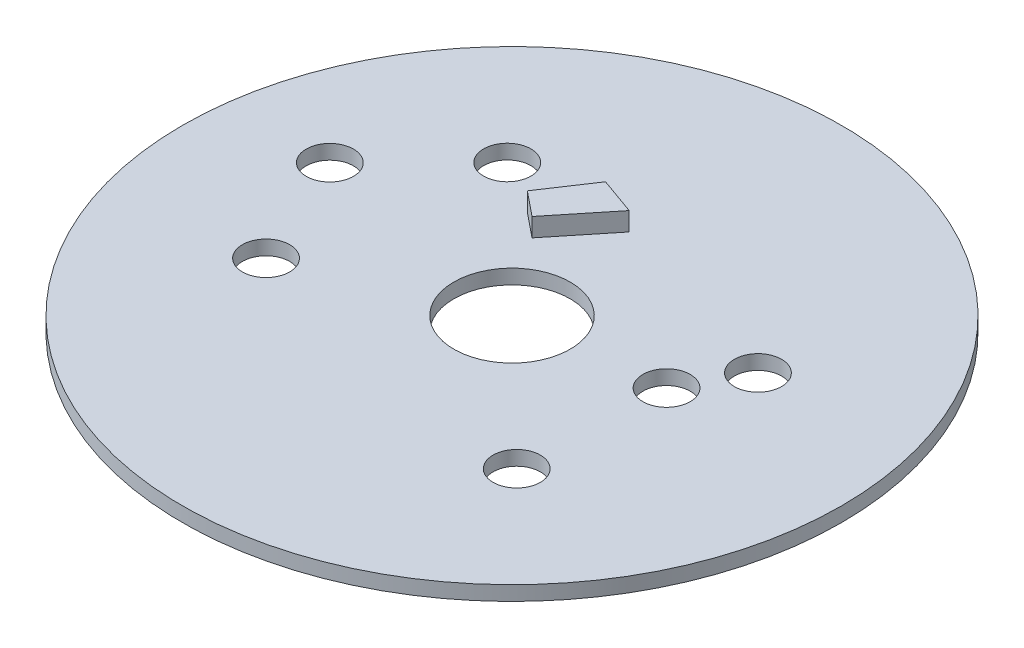
ISO-10303-21;
HEADER;
FILE_DESCRIPTION(('STEP AP214'),'2;1');
FILE_NAME('part.step','',(''),(''),'','','');
FILE_SCHEMA(('AUTOMOTIVE_DESIGN { 1 0 10303 214 1 1 1 1 }'));
ENDSEC;
DATA;
#1=APPLICATION_CONTEXT('core data for automotive mechanical design processes');
#2=APPLICATION_PROTOCOL_DEFINITION('international standard','automotive_design',2000,#1);
#3=PRODUCT_CONTEXT('',#1,'mechanical');
#4=PRODUCT('Part','Part','',(#3));
#5=PRODUCT_RELATED_PRODUCT_CATEGORY('part','',(#4));
#6=PRODUCT_DEFINITION_FORMATION('','',#4);
#7=PRODUCT_DEFINITION_CONTEXT('part definition',#1,'design');
#8=PRODUCT_DEFINITION('design','',#6,#7);
#9=PRODUCT_DEFINITION_SHAPE('','',#8);
#10=(LENGTH_UNIT() NAMED_UNIT(*) SI_UNIT(.MILLI.,.METRE.));
#11=(NAMED_UNIT(*) PLANE_ANGLE_UNIT() SI_UNIT($,.RADIAN.));
#12=(NAMED_UNIT(*) SI_UNIT($,.STERADIAN.) SOLID_ANGLE_UNIT());
#13=UNCERTAINTY_MEASURE_WITH_UNIT(LENGTH_MEASURE(1.E-05),#10,'distance_accuracy_value','');
#14=(GEOMETRIC_REPRESENTATION_CONTEXT(3) GLOBAL_UNCERTAINTY_ASSIGNED_CONTEXT((#13)) GLOBAL_UNIT_ASSIGNED_CONTEXT((#10,
#11,#12)) REPRESENTATION_CONTEXT('',''));
#15=CARTESIAN_POINT('',(0.,0.,0.));
#16=DIRECTION('',(0.,0.,1.));
#17=DIRECTION('',(1.,0.,0.));
#18=AXIS2_PLACEMENT_3D('',#15,#16,#17);
#19=CARTESIAN_POINT('',(-31.2205553056276,2.032,-5.77403034355452));
#20=DIRECTION('',(0.,-1.,0.));
#21=DIRECTION('',(1.,0.,0.));
#22=AXIS2_PLACEMENT_3D('',#19,#20,#21);
#23=CYLINDRICAL_SURFACE('',#22,3.302);
#24=CARTESIAN_POINT('',(-31.2205553056276,0.,-5.77403034355452));
#25=DIRECTION('',(0.,-1.,0.));
#26=DIRECTION('',(-1.,0.,0.));
#27=AXIS2_PLACEMENT_3D('',#24,#25,#26);
#28=CIRCLE('',#27,3.302);
#29=CARTESIAN_POINT('',(-34.5225553056276,0.,-5.77403034355452));
#30=VERTEX_POINT('',#29);
#31=EDGE_CURVE('E216',#30,#30,#28,.T.);
#32=ORIENTED_EDGE('',*,*,#31,.T.);
#33=EDGE_LOOP('',(#32));
#34=FACE_BOUND('',#33,.T.);
#35=CARTESIAN_POINT('',(-31.2205553056276,2.032,-5.77403034355452));
#36=DIRECTION('',(0.,-1.,0.));
#37=DIRECTION('',(-1.,0.,0.));
#38=AXIS2_PLACEMENT_3D('',#35,#36,#37);
#39=CIRCLE('',#38,3.302);
#40=CARTESIAN_POINT('',(-34.5225553056276,2.032,-5.77403034355452));
#41=VERTEX_POINT('',#40);
#42=EDGE_CURVE('E92',#41,#41,#39,.T.);
#43=ORIENTED_EDGE('',*,*,#42,.F.);
#44=EDGE_LOOP('',(#43));
#45=FACE_BOUND('',#44,.T.);
#46=ADVANCED_FACE('F16',(#34,#45),#23,.F.);
#47=CARTESIAN_POINT('',(0.,4.6228,0.));
#48=DIRECTION('',(0.,-1.,0.));
#49=DIRECTION('',(0.,0.,-1.));
#50=AXIS2_PLACEMENT_3D('',#47,#48,#49);
#51=PLANE('',#50);
#52=DIRECTION('',(0.9421919622594,0.,0.3350735833422));
#53=VECTOR('',#52,1.);
#54=CARTESIAN_POINT('',(-7.06686097724292,4.6228,-20.1303919424401));
#55=LINE('',#54,#53);
#56=CARTESIAN_POINT('',(-7.06686097724292,4.6228,-20.1303919424401));
#57=VERTEX_POINT('',#56);
#58=CARTESIAN_POINT('',(-1.93078502182559,4.6228,-18.3038391340596));
#59=VERTEX_POINT('',#58);
#60=EDGE_CURVE('E76',#57,#59,#55,.T.);
#61=ORIENTED_EDGE('',*,*,#60,.F.);
#62=DIRECTION('',(-0.554297162906189,0.,0.832318842267883));
#63=VECTOR('',#62,1.);
#64=CARTESIAN_POINT('',(-7.06686097724292,4.6228,-20.1303919424401));
#65=LINE('',#64,#63);
#66=CARTESIAN_POINT('',(-11.4320049606281,4.6228,-13.5758002365545));
#67=VERTEX_POINT('',#66);
#68=EDGE_CURVE('E10',#57,#67,#65,.T.);
#69=ORIENTED_EDGE('',*,*,#68,.T.);
#70=DIRECTION('',(-0.777386743589402,0.,-0.629022933517901));
#71=VECTOR('',#70,1.);
#72=CARTESIAN_POINT('',(-8.00211437614056,4.6228,-10.8005022849339));
#73=LINE('',#72,#71);
#74=CARTESIAN_POINT('',(-8.00211437614056,4.6228,-10.8005022849339));
#75=VERTEX_POINT('',#74);
#76=EDGE_CURVE('E42',#75,#67,#73,.T.);
#77=ORIENTED_EDGE('',*,*,#76,.F.);
#78=DIRECTION('',(0.629022933517901,0.,-0.777386743589402));
#79=VECTOR('',#78,1.);
#80=CARTESIAN_POINT('',(-8.00211437614056,4.6228,-10.8005022849339));
#81=LINE('',#80,#79);
#82=EDGE_CURVE('E81',#75,#59,#81,.T.);
#83=ORIENTED_EDGE('',*,*,#82,.T.);
#84=EDGE_LOOP('',(#61,#69,#77,#83));
#85=FACE_BOUND('',#84,.T.);
#86=ADVANCED_FACE('F130',(#85),#51,.F.);
#87=CARTESIAN_POINT('',(-11.2906053585892,0.,-13.7881223643605));
#88=DIRECTION('',(-0.832318842267883,0.,-0.554297162906189));
#89=DIRECTION('',(-0.554297162906189,0.,0.832318842267883));
#90=AXIS2_PLACEMENT_3D('',#87,#88,#89);
#91=PLANE('',#90);
#92=DIRECTION('',(0.,1.,0.));
#93=VECTOR('',#92,1.);
#94=CARTESIAN_POINT('',(-7.06686097724292,2.032,-20.1303919424401));
#95=LINE('',#94,#93);
#96=CARTESIAN_POINT('',(-7.06686097724292,2.032,-20.1303919424401));
#97=VERTEX_POINT('',#96);
#98=EDGE_CURVE('E114',#97,#57,#95,.T.);
#99=ORIENTED_EDGE('',*,*,#98,.F.);
#100=DIRECTION('',(0.554297162906189,0.,-0.832318842267883));
#101=VECTOR('',#100,1.);
#102=CARTESIAN_POINT('',(-11.4320049606281,2.032,-13.5758002365545));
#103=LINE('',#102,#101);
#104=CARTESIAN_POINT('',(-11.4320049606281,2.032,-13.5758002365545));
#105=VERTEX_POINT('',#104);
#106=EDGE_CURVE('E90',#105,#97,#103,.T.);
#107=ORIENTED_EDGE('',*,*,#106,.F.);
#108=DIRECTION('',(0.,1.,0.));
#109=VECTOR('',#108,1.);
#110=CARTESIAN_POINT('',(-11.4320049606281,2.032,-13.5758002365545));
#111=LINE('',#110,#109);
#112=EDGE_CURVE('E19',#105,#67,#111,.T.);
#113=ORIENTED_EDGE('',*,*,#112,.T.);
#114=ORIENTED_EDGE('',*,*,#68,.F.);
#115=EDGE_LOOP('',(#99,#107,#113,#114));
#116=FACE_BOUND('',#115,.T.);
#117=ADVANCED_FACE('F132',(#116),#91,.T.);
#118=CARTESIAN_POINT('',(-8.00211437614056,0.,-10.8005022849339));
#119=DIRECTION('',(-0.629022933517901,0.,0.777386743589402));
#120=DIRECTION('',(0.,1.,0.));
#121=AXIS2_PLACEMENT_3D('',#118,#119,#120);
#122=PLANE('',#121);
#123=DIRECTION('',(0.,1.,0.));
#124=VECTOR('',#123,1.);
#125=CARTESIAN_POINT('',(-8.00211437614056,2.032,-10.8005022849339));
#126=LINE('',#125,#124);
#127=CARTESIAN_POINT('',(-8.00211437614056,2.032,-10.8005022849339));
#128=VERTEX_POINT('',#127);
#129=EDGE_CURVE('E95',#128,#75,#126,.T.);
#130=ORIENTED_EDGE('',*,*,#129,.T.);
#131=ORIENTED_EDGE('',*,*,#76,.T.);
#132=ORIENTED_EDGE('',*,*,#112,.F.);
#133=DIRECTION('',(-0.777386743589402,0.,-0.629022933517901));
#134=VECTOR('',#133,1.);
#135=CARTESIAN_POINT('',(-8.00211437614056,2.032,-10.8005022849339));
#136=LINE('',#135,#134);
#137=EDGE_CURVE('E98',#128,#105,#136,.T.);
#138=ORIENTED_EDGE('',*,*,#137,.F.);
#139=EDGE_LOOP('',(#130,#131,#132,#138));
#140=FACE_BOUND('',#139,.T.);
#141=ADVANCED_FACE('F129',(#140),#122,.T.);
#142=CARTESIAN_POINT('',(-1.93078502182559,0.,-18.3038391340596));
#143=DIRECTION('',(0.777386743589402,0.,0.629022933517901));
#144=DIRECTION('',(0.,-1.,0.));
#145=AXIS2_PLACEMENT_3D('',#142,#143,#144);
#146=PLANE('',#145);
#147=DIRECTION('',(0.,1.,0.));
#148=VECTOR('',#147,1.);
#149=CARTESIAN_POINT('',(-1.93078502182559,2.032,-18.3038391340596));
#150=LINE('',#149,#148);
#151=CARTESIAN_POINT('',(-1.93078502182559,2.032,-18.3038391340596));
#152=VERTEX_POINT('',#151);
#153=EDGE_CURVE('E70',#152,#59,#150,.T.);
#154=ORIENTED_EDGE('',*,*,#153,.T.);
#155=ORIENTED_EDGE('',*,*,#82,.F.);
#156=ORIENTED_EDGE('',*,*,#129,.F.);
#157=DIRECTION('',(-0.629022933517901,0.,0.777386743589402));
#158=VECTOR('',#157,1.);
#159=CARTESIAN_POINT('',(-1.93078502182559,2.032,-18.3038391340596));
#160=LINE('',#159,#158);
#161=EDGE_CURVE('E88',#152,#128,#160,.T.);
#162=ORIENTED_EDGE('',*,*,#161,.F.);
#163=EDGE_LOOP('',(#154,#155,#156,#162));
#164=FACE_BOUND('',#163,.T.);
#165=ADVANCED_FACE('F94',(#164),#146,.T.);
#166=CARTESIAN_POINT('',(-7.06686097724292,0.,-20.1303919424401));
#167=DIRECTION('',(0.3350735833422,0.,-0.942191962259399));
#168=DIRECTION('',(0.,-1.,0.));
#169=AXIS2_PLACEMENT_3D('',#166,#167,#168);
#170=PLANE('',#169);
#171=ORIENTED_EDGE('',*,*,#98,.T.);
#172=ORIENTED_EDGE('',*,*,#60,.T.);
#173=ORIENTED_EDGE('',*,*,#153,.F.);
#174=DIRECTION('',(0.9421919622594,0.,0.3350735833422));
#175=VECTOR('',#174,1.);
#176=CARTESIAN_POINT('',(-7.06686097724292,2.032,-20.1303919424401));
#177=LINE('',#176,#175);
#178=EDGE_CURVE('E74',#97,#152,#177,.T.);
#179=ORIENTED_EDGE('',*,*,#178,.F.);
#180=EDGE_LOOP('',(#171,#172,#173,#179));
#181=FACE_BOUND('',#180,.T.);
#182=ADVANCED_FACE('F73',(#181),#170,.T.);
#183=CARTESIAN_POINT('',(-24.1133997009273,0.,10.2464235161976));
#184=DIRECTION('',(0.,-1.,0.));
#185=DIRECTION('',(0.,0.,-1.));
#186=AXIS2_PLACEMENT_3D('',#183,#184,#185);
#187=CYLINDRICAL_SURFACE('',#186,3.302);
#188=CARTESIAN_POINT('',(-24.1133997009273,2.032,10.2464235161976));
#189=DIRECTION('',(0.,-1.,0.));
#190=DIRECTION('',(0.,0.,1.));
#191=AXIS2_PLACEMENT_3D('',#188,#189,#190);
#192=CIRCLE('',#191,3.302);
#193=CARTESIAN_POINT('',(-24.1133997009273,2.032,13.5484235161976));
#194=VERTEX_POINT('',#193);
#195=EDGE_CURVE('E99',#194,#194,#192,.T.);
#196=ORIENTED_EDGE('',*,*,#195,.F.);
#197=EDGE_LOOP('',(#196));
#198=FACE_BOUND('',#197,.T.);
#199=CARTESIAN_POINT('',(-24.1133997009273,0.,10.2464235161976));
#200=DIRECTION('',(0.,-1.,0.));
#201=DIRECTION('',(0.,0.,1.));
#202=AXIS2_PLACEMENT_3D('',#199,#200,#201);
#203=CIRCLE('',#202,3.302);
#204=CARTESIAN_POINT('',(-24.1133997009273,0.,13.5484235161976));
#205=VERTEX_POINT('',#204);
#206=EDGE_CURVE('E222',#205,#205,#203,.T.);
#207=ORIENTED_EDGE('',*,*,#206,.T.);
#208=EDGE_LOOP('',(#207));
#209=FACE_BOUND('',#208,.T.);
#210=ADVANCED_FACE('F314',(#198,#209),#187,.F.);
#211=CARTESIAN_POINT('',(-18.8537384540454,0.,-18.1929048344782));
#212=DIRECTION('',(0.,-1.,0.));
#213=DIRECTION('',(0.,0.,-1.));
#214=AXIS2_PLACEMENT_3D('',#211,#212,#213);
#215=CYLINDRICAL_SURFACE('',#214,3.302);
#216=CARTESIAN_POINT('',(-18.8537384540454,2.032,-18.1929048344782));
#217=DIRECTION('',(0.,-1.,0.));
#218=DIRECTION('',(0.,0.,1.));
#219=AXIS2_PLACEMENT_3D('',#216,#217,#218);
#220=CIRCLE('',#219,3.302);
#221=CARTESIAN_POINT('',(-18.8537384540454,2.032,-14.8909048344783));
#222=VERTEX_POINT('',#221);
#223=EDGE_CURVE('E108',#222,#222,#220,.T.);
#224=ORIENTED_EDGE('',*,*,#223,.F.);
#225=EDGE_LOOP('',(#224));
#226=FACE_BOUND('',#225,.T.);
#227=CARTESIAN_POINT('',(-18.8537384540454,0.,-18.1929048344782));
#228=DIRECTION('',(0.,-1.,0.));
#229=DIRECTION('',(0.,0.,1.));
#230=AXIS2_PLACEMENT_3D('',#227,#228,#229);
#231=CIRCLE('',#230,3.302);
#232=CARTESIAN_POINT('',(-18.8537384540454,0.,-14.8909048344783));
#233=VERTEX_POINT('',#232);
#234=EDGE_CURVE('E230',#233,#233,#231,.T.);
#235=ORIENTED_EDGE('',*,*,#234,.T.);
#236=EDGE_LOOP('',(#235));
#237=FACE_BOUND('',#236,.T.);
#238=ADVANCED_FACE('F310',(#226,#237),#215,.F.);
#239=CARTESIAN_POINT('',(24.1133997009273,0.,-10.2464235161976));
#240=DIRECTION('',(0.,-1.,0.));
#241=DIRECTION('',(0.,0.,-1.));
#242=AXIS2_PLACEMENT_3D('',#239,#240,#241);
#243=CYLINDRICAL_SURFACE('',#242,3.302);
#244=CARTESIAN_POINT('',(24.1133997009273,2.032,-10.2464235161976));
#245=DIRECTION('',(0.,-1.,0.));
#246=DIRECTION('',(0.,0.,1.));
#247=AXIS2_PLACEMENT_3D('',#244,#245,#246);
#248=CIRCLE('',#247,3.302);
#249=CARTESIAN_POINT('',(24.1133997009273,2.032,-6.94442351619758));
#250=VERTEX_POINT('',#249);
#251=EDGE_CURVE('E187',#250,#250,#248,.T.);
#252=ORIENTED_EDGE('',*,*,#251,.F.);
#253=EDGE_LOOP('',(#252));
#254=FACE_BOUND('',#253,.T.);
#255=CARTESIAN_POINT('',(24.1133997009273,0.,-10.2464235161976));
#256=DIRECTION('',(0.,-1.,0.));
#257=DIRECTION('',(0.,0.,1.));
#258=AXIS2_PLACEMENT_3D('',#255,#256,#257);
#259=CIRCLE('',#258,3.302);
#260=CARTESIAN_POINT('',(24.1133997009273,0.,-6.94442351619758));
#261=VERTEX_POINT('',#260);
#262=EDGE_CURVE('E234',#261,#261,#259,.T.);
#263=ORIENTED_EDGE('',*,*,#262,.T.);
#264=EDGE_LOOP('',(#263));
#265=FACE_BOUND('',#264,.T.);
#266=ADVANCED_FACE('F313',(#254,#265),#243,.F.);
#267=CARTESIAN_POINT('',(18.8537384540454,0.,18.1929048344782));
#268=DIRECTION('',(0.,-1.,0.));
#269=DIRECTION('',(0.,0.,-1.));
#270=AXIS2_PLACEMENT_3D('',#267,#268,#269);
#271=CYLINDRICAL_SURFACE('',#270,3.302);
#272=CARTESIAN_POINT('',(18.8537384540454,2.032,18.1929048344782));
#273=DIRECTION('',(0.,-1.,0.));
#274=DIRECTION('',(0.,0.,1.));
#275=AXIS2_PLACEMENT_3D('',#272,#273,#274);
#276=CIRCLE('',#275,3.302);
#277=CARTESIAN_POINT('',(18.8537384540454,2.032,21.4949048344782));
#278=VERTEX_POINT('',#277);
#279=EDGE_CURVE('E182',#278,#278,#276,.T.);
#280=ORIENTED_EDGE('',*,*,#279,.F.);
#281=EDGE_LOOP('',(#280));
#282=FACE_BOUND('',#281,.T.);
#283=CARTESIAN_POINT('',(18.8537384540454,0.,18.1929048344782));
#284=DIRECTION('',(0.,-1.,0.));
#285=DIRECTION('',(0.,0.,1.));
#286=AXIS2_PLACEMENT_3D('',#283,#284,#285);
#287=CIRCLE('',#286,3.302);
#288=CARTESIAN_POINT('',(18.8537384540454,0.,21.4949048344782));
#289=VERTEX_POINT('',#288);
#290=EDGE_CURVE('E240',#289,#289,#287,.T.);
#291=ORIENTED_EDGE('',*,*,#290,.T.);
#292=EDGE_LOOP('',(#291));
#293=FACE_BOUND('',#292,.T.);
#294=ADVANCED_FACE('F367',(#282,#293),#271,.F.);
#295=CARTESIAN_POINT('',(19.558,2.032,-2.032));
#296=DIRECTION('',(0.,1.,0.));
#297=DIRECTION('',(1.,0.,0.));
#298=AXIS2_PLACEMENT_3D('',#295,#296,#297);
#299=CYLINDRICAL_SURFACE('',#298,3.302);
#300=CARTESIAN_POINT('',(19.558,0.,-2.032));
#301=DIRECTION('',(0.,1.,0.));
#302=DIRECTION('',(-1.,0.,0.));
#303=AXIS2_PLACEMENT_3D('',#300,#301,#302);
#304=CIRCLE('',#303,3.302);
#305=CARTESIAN_POINT('',(16.256,0.,-2.032));
#306=VERTEX_POINT('',#305);
#307=EDGE_CURVE('E254',#306,#306,#304,.T.);
#308=ORIENTED_EDGE('',*,*,#307,.F.);
#309=EDGE_LOOP('',(#308));
#310=FACE_BOUND('',#309,.T.);
#311=CARTESIAN_POINT('',(19.558,2.032,-2.032));
#312=DIRECTION('',(0.,1.,0.));
#313=DIRECTION('',(-1.,0.,0.));
#314=AXIS2_PLACEMENT_3D('',#311,#312,#313);
#315=CIRCLE('',#314,3.302);
#316=CARTESIAN_POINT('',(16.256,2.032,-2.032));
#317=VERTEX_POINT('',#316);
#318=EDGE_CURVE('E188',#317,#317,#315,.T.);
#319=ORIENTED_EDGE('',*,*,#318,.T.);
#320=EDGE_LOOP('',(#319));
#321=FACE_BOUND('',#320,.T.);
#322=ADVANCED_FACE('F365',(#310,#321),#299,.F.);
#323=CARTESIAN_POINT('',(0.,2.032,0.));
#324=DIRECTION('',(0.,1.,0.));
#325=DIRECTION('',(1.,0.,0.));
#326=AXIS2_PLACEMENT_3D('',#323,#324,#325);
#327=CYLINDRICAL_SURFACE('',#326,8.128);
#328=CARTESIAN_POINT('',(0.,0.,0.));
#329=DIRECTION('',(0.,1.,0.));
#330=DIRECTION('',(-1.,0.,0.));
#331=AXIS2_PLACEMENT_3D('',#328,#329,#330);
#332=CIRCLE('',#331,8.128);
#333=CARTESIAN_POINT('',(-8.128,0.,0.));
#334=VERTEX_POINT('',#333);
#335=EDGE_CURVE('E262',#334,#334,#332,.T.);
#336=ORIENTED_EDGE('',*,*,#335,.F.);
#337=EDGE_LOOP('',(#336));
#338=FACE_BOUND('',#337,.T.);
#339=CARTESIAN_POINT('',(0.,2.032,0.));
#340=DIRECTION('',(0.,1.,0.));
#341=DIRECTION('',(-1.,0.,0.));
#342=AXIS2_PLACEMENT_3D('',#339,#340,#341);
#343=CIRCLE('',#342,8.128);
#344=CARTESIAN_POINT('',(-8.128,2.032,0.));
#345=VERTEX_POINT('',#344);
#346=EDGE_CURVE('E198',#345,#345,#343,.T.);
#347=ORIENTED_EDGE('',*,*,#346,.T.);
#348=EDGE_LOOP('',(#347));
#349=FACE_BOUND('',#348,.T.);
#350=ADVANCED_FACE('F340',(#338,#349),#327,.F.);
#351=CARTESIAN_POINT('',(0.,2.032,0.));
#352=DIRECTION('',(0.,1.,0.));
#353=DIRECTION('',(1.,0.,0.));
#354=AXIS2_PLACEMENT_3D('',#351,#352,#353);
#355=PLANE('',#354);
#356=ORIENTED_EDGE('',*,*,#42,.T.);
#357=EDGE_LOOP('',(#356));
#358=FACE_BOUND('',#357,.T.);
#359=ORIENTED_EDGE('',*,*,#161,.T.);
#360=ORIENTED_EDGE('',*,*,#137,.T.);
#361=ORIENTED_EDGE('',*,*,#106,.T.);
#362=ORIENTED_EDGE('',*,*,#178,.T.);
#363=EDGE_LOOP('',(#359,#360,#361,#362));
#364=FACE_BOUND('',#363,.T.);
#365=ORIENTED_EDGE('',*,*,#195,.T.);
#366=EDGE_LOOP('',(#365));
#367=FACE_BOUND('',#366,.T.);
#368=ORIENTED_EDGE('',*,*,#223,.T.);
#369=EDGE_LOOP('',(#368));
#370=FACE_BOUND('',#369,.T.);
#371=ORIENTED_EDGE('',*,*,#251,.T.);
#372=EDGE_LOOP('',(#371));
#373=FACE_BOUND('',#372,.T.);
#374=ORIENTED_EDGE('',*,*,#279,.T.);
#375=EDGE_LOOP('',(#374));
#376=FACE_BOUND('',#375,.T.);
#377=ORIENTED_EDGE('',*,*,#318,.F.);
#378=EDGE_LOOP('',(#377));
#379=FACE_BOUND('',#378,.T.);
#380=ORIENTED_EDGE('',*,*,#346,.F.);
#381=EDGE_LOOP('',(#380));
#382=FACE_BOUND('',#381,.T.);
#383=CARTESIAN_POINT('',(0.,2.032,0.));
#384=DIRECTION('',(0.,1.,0.));
#385=DIRECTION('',(1.,0.,0.));
#386=AXIS2_PLACEMENT_3D('',#383,#384,#385);
#387=CIRCLE('',#386,46.0375);
#388=CARTESIAN_POINT('',(46.0375,2.032,0.));
#389=VERTEX_POINT('',#388);
#390=EDGE_CURVE('E206',#389,#389,#387,.T.);
#391=ORIENTED_EDGE('',*,*,#390,.T.);
#392=EDGE_LOOP('',(#391));
#393=FACE_BOUND('',#392,.T.);
#394=ADVANCED_FACE('F85',(#358,#364,#367,#370,#373,#376,#379,#382,#393),#355,.T.);
#395=CARTESIAN_POINT('',(0.,0.,0.));
#396=DIRECTION('',(0.,1.,0.));
#397=DIRECTION('',(1.,0.,0.));
#398=AXIS2_PLACEMENT_3D('',#395,#396,#397);
#399=CYLINDRICAL_SURFACE('',#398,46.0375);
#400=ORIENTED_EDGE('',*,*,#390,.F.);
#401=EDGE_LOOP('',(#400));
#402=FACE_BOUND('',#401,.T.);
#403=CARTESIAN_POINT('',(0.,0.,0.));
#404=DIRECTION('',(0.,1.,0.));
#405=DIRECTION('',(-1.,0.,0.));
#406=AXIS2_PLACEMENT_3D('',#403,#404,#405);
#407=CIRCLE('',#406,46.0375);
#408=CARTESIAN_POINT('',(-46.0375,0.,0.));
#409=VERTEX_POINT('',#408);
#410=EDGE_CURVE('E270',#409,#409,#407,.T.);
#411=ORIENTED_EDGE('',*,*,#410,.T.);
#412=EDGE_LOOP('',(#411));
#413=FACE_BOUND('',#412,.T.);
#414=ADVANCED_FACE('F321',(#402,#413),#399,.T.);
#415=CARTESIAN_POINT('',(0.,0.,0.));
#416=DIRECTION('',(0.,1.,0.));
#417=DIRECTION('',(1.,0.,0.));
#418=AXIS2_PLACEMENT_3D('',#415,#416,#417);
#419=PLANE('',#418);
#420=ORIENTED_EDGE('',*,*,#31,.F.);
#421=EDGE_LOOP('',(#420));
#422=FACE_BOUND('',#421,.T.);
#423=ORIENTED_EDGE('',*,*,#206,.F.);
#424=EDGE_LOOP('',(#423));
#425=FACE_BOUND('',#424,.T.);
#426=ORIENTED_EDGE('',*,*,#234,.F.);
#427=EDGE_LOOP('',(#426));
#428=FACE_BOUND('',#427,.T.);
#429=ORIENTED_EDGE('',*,*,#262,.F.);
#430=EDGE_LOOP('',(#429));
#431=FACE_BOUND('',#430,.T.);
#432=ORIENTED_EDGE('',*,*,#290,.F.);
#433=EDGE_LOOP('',(#432));
#434=FACE_BOUND('',#433,.T.);
#435=ORIENTED_EDGE('',*,*,#307,.T.);
#436=EDGE_LOOP('',(#435));
#437=FACE_BOUND('',#436,.T.);
#438=ORIENTED_EDGE('',*,*,#335,.T.);
#439=EDGE_LOOP('',(#438));
#440=FACE_BOUND('',#439,.T.);
#441=ORIENTED_EDGE('',*,*,#410,.F.);
#442=EDGE_LOOP('',(#441));
#443=FACE_BOUND('',#442,.T.);
#444=ADVANCED_FACE('F318',(#422,#425,#428,#431,#434,#437,#440,#443),#419,.F.);
#445=CLOSED_SHELL('',(#46,#86,#117,#141,#165,#182,#210,#238,#266,#294,#322,#350,#394,#414,#444));
#446=MANIFOLD_SOLID_BREP('B1',#445);
#447=ADVANCED_BREP_SHAPE_REPRESENTATION('',(#18,#446),#14);
#448=SHAPE_DEFINITION_REPRESENTATION(#9,#447);
ENDSEC;
END-ISO-10303-21;
